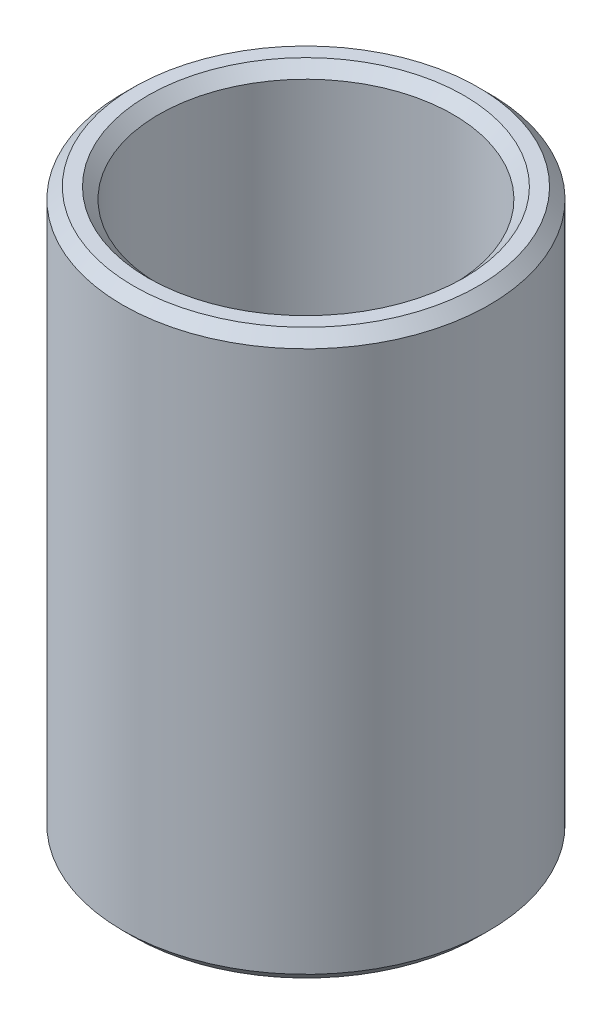
ISO-10303-21;
HEADER;
FILE_DESCRIPTION(('STEP AP214'),'2;1');
FILE_NAME('part.step','',(''),(''),'','','');
FILE_SCHEMA(('AUTOMOTIVE_DESIGN { 1 0 10303 214 1 1 1 1 }'));
ENDSEC;
DATA;
#1=APPLICATION_CONTEXT('core data for automotive mechanical design processes');
#2=APPLICATION_PROTOCOL_DEFINITION('international standard','automotive_design',2000,#1);
#3=PRODUCT_CONTEXT('',#1,'mechanical');
#4=PRODUCT('Part','Part','',(#3));
#5=PRODUCT_RELATED_PRODUCT_CATEGORY('part','',(#4));
#6=PRODUCT_DEFINITION_FORMATION('','',#4);
#7=PRODUCT_DEFINITION_CONTEXT('part definition',#1,'design');
#8=PRODUCT_DEFINITION('design','',#6,#7);
#9=PRODUCT_DEFINITION_SHAPE('','',#8);
#10=(LENGTH_UNIT() NAMED_UNIT(*) SI_UNIT(.MILLI.,.METRE.));
#11=(NAMED_UNIT(*) PLANE_ANGLE_UNIT() SI_UNIT($,.RADIAN.));
#12=(NAMED_UNIT(*) SI_UNIT($,.STERADIAN.) SOLID_ANGLE_UNIT());
#13=UNCERTAINTY_MEASURE_WITH_UNIT(LENGTH_MEASURE(1.E-05),#10,'distance_accuracy_value','');
#14=(GEOMETRIC_REPRESENTATION_CONTEXT(3) GLOBAL_UNCERTAINTY_ASSIGNED_CONTEXT((#13)) GLOBAL_UNIT_ASSIGNED_CONTEXT((#10,
#11,#12)) REPRESENTATION_CONTEXT('',''));
#15=CARTESIAN_POINT('',(0.,0.,0.));
#16=DIRECTION('',(0.,0.,1.));
#17=DIRECTION('',(1.,0.,0.));
#18=AXIS2_PLACEMENT_3D('',#15,#16,#17);
#19=CARTESIAN_POINT('',(0.,46.1408772208004,0.));
#20=DIRECTION('',(0.,-1.,0.));
#21=DIRECTION('',(0.,0.,-1.));
#22=AXIS2_PLACEMENT_3D('',#19,#20,#21);
#23=CYLINDRICAL_SURFACE('',#22,15.);
#24=CARTESIAN_POINT('',(0.,0.896203246899492,0.));
#25=DIRECTION('',(0.,1.,0.));
#26=DIRECTION('',(0.,0.,1.));
#27=AXIS2_PLACEMENT_3D('',#24,#25,#26);
#28=CIRCLE('',#27,15.);
#29=CARTESIAN_POINT('',(0.,0.896203246899492,15.));
#30=VERTEX_POINT('',#29);
#31=EDGE_CURVE('E10',#30,#30,#28,.T.);
#32=ORIENTED_EDGE('',*,*,#31,.T.);
#33=EDGE_LOOP('',(#32));
#34=FACE_BOUND('',#33,.T.);
#35=CARTESIAN_POINT('',(0.,45.2446739739008,0.));
#36=DIRECTION('',(0.,1.,0.));
#37=DIRECTION('',(0.,0.,1.));
#38=AXIS2_PLACEMENT_3D('',#35,#36,#37);
#39=CIRCLE('',#38,15.);
#40=CARTESIAN_POINT('',(0.,45.2446739739008,15.));
#41=VERTEX_POINT('',#40);
#42=EDGE_CURVE('E50',#41,#41,#39,.F.);
#43=ORIENTED_EDGE('',*,*,#42,.T.);
#44=EDGE_LOOP('',(#43));
#45=FACE_BOUND('',#44,.T.);
#46=ADVANCED_FACE('F39',(#34,#45),#23,.T.);
#47=CARTESIAN_POINT('',(0.,46.1408772208004,0.));
#48=DIRECTION('',(0.,1.,0.));
#49=DIRECTION('',(0.,0.,1.));
#50=AXIS2_PLACEMENT_3D('',#47,#48,#49);
#51=PLANE('',#50);
#52=CARTESIAN_POINT('',(0.,46.1408772208004,0.));
#53=DIRECTION('',(0.,1.,0.));
#54=DIRECTION('',(0.,0.,1.));
#55=AXIS2_PLACEMENT_3D('',#52,#53,#54);
#56=CIRCLE('',#55,12.9374978219591);
#57=CARTESIAN_POINT('',(0.,46.1408772208004,12.9374978219591));
#58=VERTEX_POINT('',#57);
#59=EDGE_CURVE('E58',#58,#58,#56,.F.);
#60=ORIENTED_EDGE('',*,*,#59,.T.);
#61=EDGE_LOOP('',(#60));
#62=FACE_BOUND('',#61,.T.);
#63=CARTESIAN_POINT('',(0.,46.1408772208004,0.));
#64=DIRECTION('',(0.,1.,0.));
#65=DIRECTION('',(0.,0.,1.));
#66=AXIS2_PLACEMENT_3D('',#63,#64,#65);
#67=CIRCLE('',#66,14.1037967531005);
#68=CARTESIAN_POINT('',(0.,46.1408772208004,14.1037967531005));
#69=VERTEX_POINT('',#68);
#70=EDGE_CURVE('E61',#69,#69,#67,.T.);
#71=ORIENTED_EDGE('',*,*,#70,.T.);
#72=EDGE_LOOP('',(#71));
#73=FACE_BOUND('',#72,.T.);
#74=ADVANCED_FACE('F88',(#62,#73),#51,.T.);
#75=CARTESIAN_POINT('',(0.,0.,0.));
#76=DIRECTION('',(0.,1.,0.));
#77=DIRECTION('',(0.,0.,1.));
#78=AXIS2_PLACEMENT_3D('',#75,#76,#77);
#79=PLANE('',#78);
#80=CARTESIAN_POINT('',(0.,0.,0.));
#81=DIRECTION('',(0.,1.,0.));
#82=DIRECTION('',(0.,0.,1.));
#83=AXIS2_PLACEMENT_3D('',#80,#81,#82);
#84=CIRCLE('',#83,12.9374978219591);
#85=CARTESIAN_POINT('',(0.,0.,12.9374978219591));
#86=VERTEX_POINT('',#85);
#87=EDGE_CURVE('E51',#86,#86,#84,.T.);
#88=ORIENTED_EDGE('',*,*,#87,.T.);
#89=EDGE_LOOP('',(#88));
#90=FACE_BOUND('',#89,.T.);
#91=CARTESIAN_POINT('',(0.,0.,0.));
#92=DIRECTION('',(0.,1.,0.));
#93=DIRECTION('',(0.,0.,1.));
#94=AXIS2_PLACEMENT_3D('',#91,#92,#93);
#95=CIRCLE('',#94,14.1037967531005);
#96=CARTESIAN_POINT('',(0.,0.,14.1037967531005));
#97=VERTEX_POINT('',#96);
#98=EDGE_CURVE('E54',#97,#97,#95,.F.);
#99=ORIENTED_EDGE('',*,*,#98,.T.);
#100=EDGE_LOOP('',(#99));
#101=FACE_BOUND('',#100,.T.);
#102=ADVANCED_FACE('F83',(#90,#101),#79,.F.);
#103=CARTESIAN_POINT('',(0.,46.1408772208004,0.));
#104=DIRECTION('',(0.,-1.,0.));
#105=DIRECTION('',(0.,0.,-1.));
#106=AXIS2_PLACEMENT_3D('',#103,#104,#105);
#107=CYLINDRICAL_SURFACE('',#106,12.0412945750596);
#108=CARTESIAN_POINT('',(0.,45.2446739739009,0.));
#109=DIRECTION('',(0.,1.,0.));
#110=DIRECTION('',(0.,0.,1.));
#111=AXIS2_PLACEMENT_3D('',#108,#109,#110);
#112=CIRCLE('',#111,12.0412945750596);
#113=CARTESIAN_POINT('',(0.,45.2446739739009,12.0412945750596));
#114=VERTEX_POINT('',#113);
#115=EDGE_CURVE('E67',#114,#114,#112,.T.);
#116=ORIENTED_EDGE('',*,*,#115,.T.);
#117=EDGE_LOOP('',(#116));
#118=FACE_BOUND('',#117,.T.);
#119=CARTESIAN_POINT('',(0.,0.896203246899506,0.));
#120=DIRECTION('',(0.,1.,0.));
#121=DIRECTION('',(0.,0.,1.));
#122=AXIS2_PLACEMENT_3D('',#119,#120,#121);
#123=CIRCLE('',#122,12.0412945750596);
#124=CARTESIAN_POINT('',(0.,0.896203246899506,12.0412945750596));
#125=VERTEX_POINT('',#124);
#126=EDGE_CURVE('E69',#125,#125,#123,.F.);
#127=ORIENTED_EDGE('',*,*,#126,.T.);
#128=EDGE_LOOP('',(#127));
#129=FACE_BOUND('',#128,.T.);
#130=ADVANCED_FACE('F71',(#118,#129),#107,.F.);
#131=CARTESIAN_POINT('',(0.,45.2446739739009,0.));
#132=DIRECTION('',(0.,1.,0.));
#133=DIRECTION('',(0.,0.,1.));
#134=AXIS2_PLACEMENT_3D('',#131,#132,#133);
#135=CONICAL_SURFACE('',#134,12.0412945750596,0.785398163397447);
#136=ORIENTED_EDGE('',*,*,#59,.F.);
#137=EDGE_LOOP('',(#136));
#138=FACE_BOUND('',#137,.T.);
#139=ORIENTED_EDGE('',*,*,#115,.F.);
#140=EDGE_LOOP('',(#139));
#141=FACE_BOUND('',#140,.T.);
#142=ADVANCED_FACE('F77',(#138,#141),#135,.F.);
#143=CARTESIAN_POINT('',(0.,0.,0.));
#144=DIRECTION('',(0.,-1.,0.));
#145=DIRECTION('',(0.,0.,-1.));
#146=AXIS2_PLACEMENT_3D('',#143,#144,#145);
#147=CONICAL_SURFACE('',#146,12.9374978219591,0.785398163397445);
#148=ORIENTED_EDGE('',*,*,#126,.F.);
#149=EDGE_LOOP('',(#148));
#150=FACE_BOUND('',#149,.T.);
#151=ORIENTED_EDGE('',*,*,#87,.F.);
#152=EDGE_LOOP('',(#151));
#153=FACE_BOUND('',#152,.T.);
#154=ADVANCED_FACE('F73',(#150,#153),#147,.F.);
#155=CARTESIAN_POINT('',(0.,0.896203246899492,0.));
#156=DIRECTION('',(0.,1.,0.));
#157=DIRECTION('',(0.,0.,1.));
#158=AXIS2_PLACEMENT_3D('',#155,#156,#157);
#159=CONICAL_SURFACE('',#158,15.,0.78539816339745);
#160=ORIENTED_EDGE('',*,*,#98,.F.);
#161=EDGE_LOOP('',(#160));
#162=FACE_BOUND('',#161,.T.);
#163=ORIENTED_EDGE('',*,*,#31,.F.);
#164=EDGE_LOOP('',(#163));
#165=FACE_BOUND('',#164,.T.);
#166=ADVANCED_FACE('F76',(#162,#165),#159,.T.);
#167=CARTESIAN_POINT('',(0.,46.1408772208004,0.));
#168=DIRECTION('',(0.,-1.,0.));
#169=DIRECTION('',(0.,0.,-1.));
#170=AXIS2_PLACEMENT_3D('',#167,#168,#169);
#171=CONICAL_SURFACE('',#170,14.1037967531005,0.785398163397445);
#172=ORIENTED_EDGE('',*,*,#42,.F.);
#173=EDGE_LOOP('',(#172));
#174=FACE_BOUND('',#173,.T.);
#175=ORIENTED_EDGE('',*,*,#70,.F.);
#176=EDGE_LOOP('',(#175));
#177=FACE_BOUND('',#176,.T.);
#178=ADVANCED_FACE('F45',(#174,#177),#171,.T.);
#179=CLOSED_SHELL('',(#46,#74,#102,#130,#142,#154,#166,#178));
#180=MANIFOLD_SOLID_BREP('B2',#179);
#181=ADVANCED_BREP_SHAPE_REPRESENTATION('',(#18,#180),#14);
#182=SHAPE_DEFINITION_REPRESENTATION(#9,#181);
ENDSEC;
END-ISO-10303-21;
